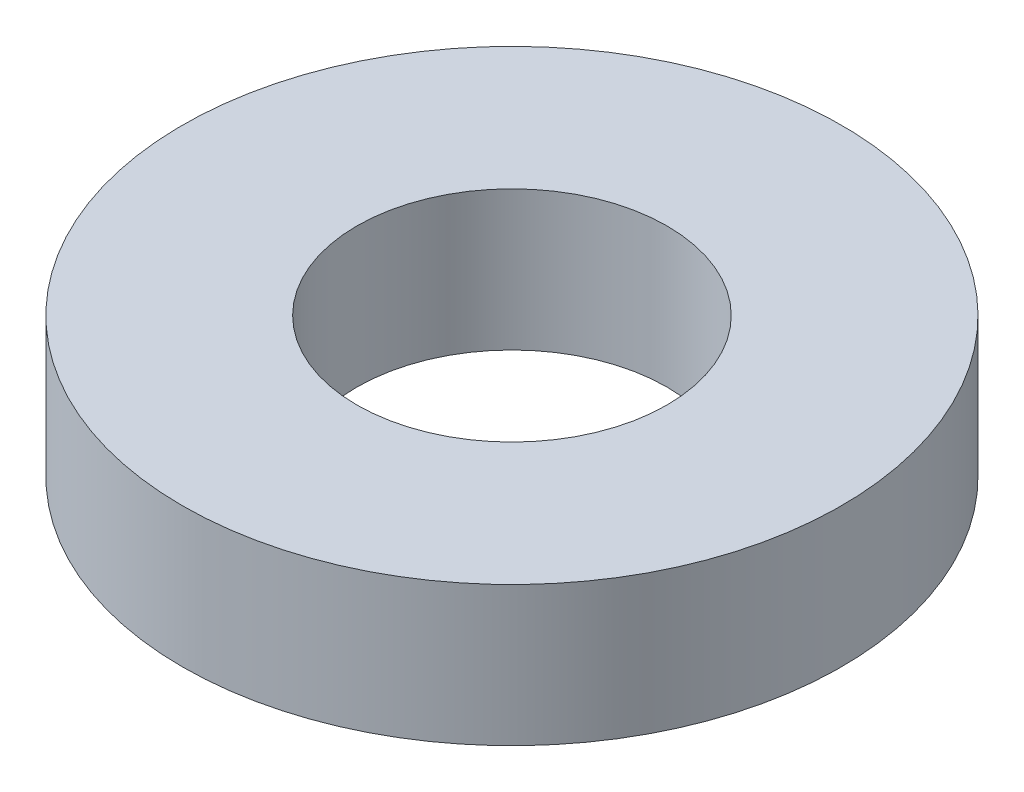
ISO-10303-21;
HEADER;
FILE_DESCRIPTION(('STEP AP214'),'2;1');
FILE_NAME('part.step','',(''),(''),'','','');
FILE_SCHEMA(('AUTOMOTIVE_DESIGN { 1 0 10303 214 1 1 1 1 }'));
ENDSEC;
DATA;
#1=APPLICATION_CONTEXT('core data for automotive mechanical design processes');
#2=APPLICATION_PROTOCOL_DEFINITION('international standard','automotive_design',2000,#1);
#3=PRODUCT_CONTEXT('',#1,'mechanical');
#4=PRODUCT('Part','Part','',(#3));
#5=PRODUCT_RELATED_PRODUCT_CATEGORY('part','',(#4));
#6=PRODUCT_DEFINITION_FORMATION('','',#4);
#7=PRODUCT_DEFINITION_CONTEXT('part definition',#1,'design');
#8=PRODUCT_DEFINITION('design','',#6,#7);
#9=PRODUCT_DEFINITION_SHAPE('','',#8);
#10=(LENGTH_UNIT() NAMED_UNIT(*) SI_UNIT(.MILLI.,.METRE.));
#11=(NAMED_UNIT(*) PLANE_ANGLE_UNIT() SI_UNIT($,.RADIAN.));
#12=(NAMED_UNIT(*) SI_UNIT($,.STERADIAN.) SOLID_ANGLE_UNIT());
#13=UNCERTAINTY_MEASURE_WITH_UNIT(LENGTH_MEASURE(1.E-05),#10,'distance_accuracy_value','');
#14=(GEOMETRIC_REPRESENTATION_CONTEXT(3) GLOBAL_UNCERTAINTY_ASSIGNED_CONTEXT((#13)) GLOBAL_UNIT_ASSIGNED_CONTEXT((#10,
#11,#12)) REPRESENTATION_CONTEXT('',''));
#15=CARTESIAN_POINT('',(0.,0.,0.));
#16=DIRECTION('',(0.,0.,1.));
#17=DIRECTION('',(1.,0.,0.));
#18=AXIS2_PLACEMENT_3D('',#15,#16,#17);
#19=CARTESIAN_POINT('',(0.,18.,0.));
#20=DIRECTION('',(0.,-1.,0.));
#21=DIRECTION('',(0.,0.,-1.));
#22=AXIS2_PLACEMENT_3D('',#19,#20,#21);
#23=CYLINDRICAL_SURFACE('',#22,42.5);
#24=CARTESIAN_POINT('',(0.,18.,0.));
#25=DIRECTION('',(0.,1.,0.));
#26=DIRECTION('',(0.,0.,1.));
#27=AXIS2_PLACEMENT_3D('',#24,#25,#26);
#28=CIRCLE('',#27,42.5);
#29=CARTESIAN_POINT('',(0.,18.,42.5));
#30=VERTEX_POINT('',#29);
#31=EDGE_CURVE('E10',#30,#30,#28,.T.);
#32=ORIENTED_EDGE('',*,*,#31,.F.);
#33=EDGE_LOOP('',(#32));
#34=FACE_BOUND('',#33,.T.);
#35=CARTESIAN_POINT('',(0.,0.,0.));
#36=DIRECTION('',(0.,1.,0.));
#37=DIRECTION('',(0.,0.,1.));
#38=AXIS2_PLACEMENT_3D('',#35,#36,#37);
#39=CIRCLE('',#38,42.5);
#40=CARTESIAN_POINT('',(0.,0.,42.5));
#41=VERTEX_POINT('',#40);
#42=EDGE_CURVE('E37',#41,#41,#39,.T.);
#43=ORIENTED_EDGE('',*,*,#42,.T.);
#44=EDGE_LOOP('',(#43));
#45=FACE_BOUND('',#44,.T.);
#46=ADVANCED_FACE('F40',(#34,#45),#23,.T.);
#47=CARTESIAN_POINT('',(0.,18.,0.));
#48=DIRECTION('',(0.,1.,0.));
#49=DIRECTION('',(0.,0.,1.));
#50=AXIS2_PLACEMENT_3D('',#47,#48,#49);
#51=PLANE('',#50);
#52=CARTESIAN_POINT('',(0.,18.,0.));
#53=DIRECTION('',(0.,1.,0.));
#54=DIRECTION('',(0.,0.,1.));
#55=AXIS2_PLACEMENT_3D('',#52,#53,#54);
#56=CIRCLE('',#55,20.);
#57=CARTESIAN_POINT('',(0.,18.,20.));
#58=VERTEX_POINT('',#57);
#59=EDGE_CURVE('E50',#58,#58,#56,.T.);
#60=ORIENTED_EDGE('',*,*,#59,.F.);
#61=EDGE_LOOP('',(#60));
#62=FACE_BOUND('',#61,.T.);
#63=ORIENTED_EDGE('',*,*,#31,.T.);
#64=EDGE_LOOP('',(#63));
#65=FACE_BOUND('',#64,.T.);
#66=ADVANCED_FACE('F59',(#62,#65),#51,.T.);
#67=CARTESIAN_POINT('',(0.,0.,0.));
#68=DIRECTION('',(0.,1.,0.));
#69=DIRECTION('',(0.,0.,1.));
#70=AXIS2_PLACEMENT_3D('',#67,#68,#69);
#71=PLANE('',#70);
#72=CARTESIAN_POINT('',(0.,0.,0.));
#73=DIRECTION('',(0.,1.,0.));
#74=DIRECTION('',(0.,0.,1.));
#75=AXIS2_PLACEMENT_3D('',#72,#73,#74);
#76=CIRCLE('',#75,20.);
#77=CARTESIAN_POINT('',(0.,0.,20.));
#78=VERTEX_POINT('',#77);
#79=EDGE_CURVE('E47',#78,#78,#76,.T.);
#80=ORIENTED_EDGE('',*,*,#79,.T.);
#81=EDGE_LOOP('',(#80));
#82=FACE_BOUND('',#81,.T.);
#83=ORIENTED_EDGE('',*,*,#42,.F.);
#84=EDGE_LOOP('',(#83));
#85=FACE_BOUND('',#84,.T.);
#86=ADVANCED_FACE('F58',(#82,#85),#71,.F.);
#87=CARTESIAN_POINT('',(0.,18.,0.));
#88=DIRECTION('',(0.,-1.,0.));
#89=DIRECTION('',(0.,0.,-1.));
#90=AXIS2_PLACEMENT_3D('',#87,#88,#89);
#91=CYLINDRICAL_SURFACE('',#90,20.);
#92=ORIENTED_EDGE('',*,*,#59,.T.);
#93=EDGE_LOOP('',(#92));
#94=FACE_BOUND('',#93,.T.);
#95=ORIENTED_EDGE('',*,*,#79,.F.);
#96=EDGE_LOOP('',(#95));
#97=FACE_BOUND('',#96,.T.);
#98=ADVANCED_FACE('F54',(#94,#97),#91,.F.);
#99=CLOSED_SHELL('',(#46,#66,#86,#98));
#100=MANIFOLD_SOLID_BREP('B2',#99);
#101=ADVANCED_BREP_SHAPE_REPRESENTATION('',(#18,#100),#14);
#102=SHAPE_DEFINITION_REPRESENTATION(#9,#101);
ENDSEC;
END-ISO-10303-21;
